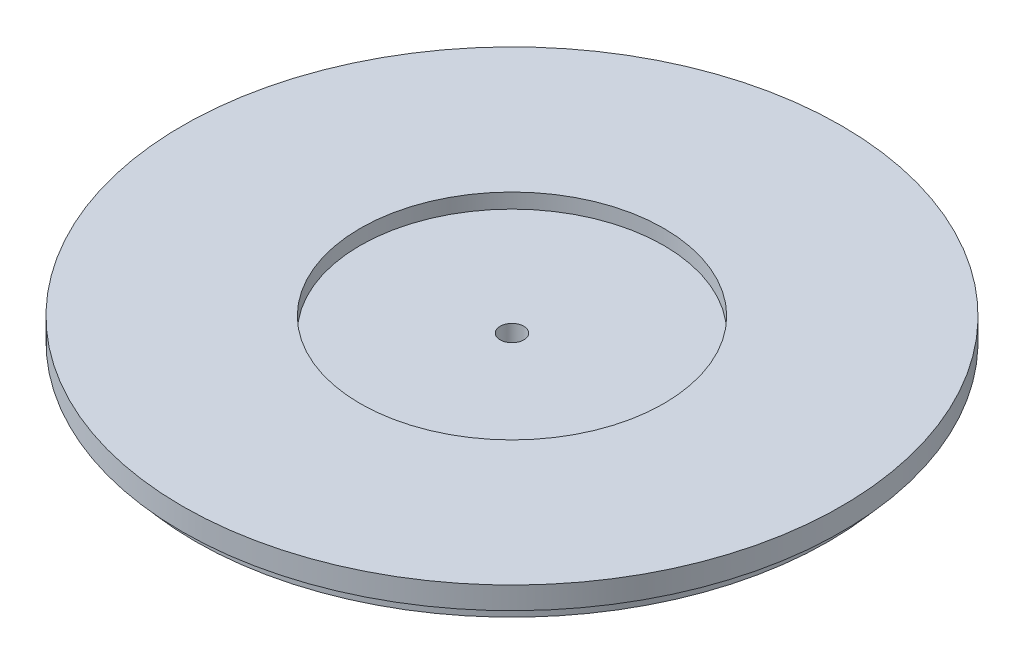
ISO-10303-21;
HEADER;
FILE_DESCRIPTION(('STEP AP214'),'2;1');
FILE_NAME('part.step','',(''),(''),'','','');
FILE_SCHEMA(('AUTOMOTIVE_DESIGN { 1 0 10303 214 1 1 1 1 }'));
ENDSEC;
DATA;
#1=APPLICATION_CONTEXT('core data for automotive mechanical design processes');
#2=APPLICATION_PROTOCOL_DEFINITION('international standard','automotive_design',2000,#1);
#3=PRODUCT_CONTEXT('',#1,'mechanical');
#4=PRODUCT('Part','Part','',(#3));
#5=PRODUCT_RELATED_PRODUCT_CATEGORY('part','',(#4));
#6=PRODUCT_DEFINITION_FORMATION('','',#4);
#7=PRODUCT_DEFINITION_CONTEXT('part definition',#1,'design');
#8=PRODUCT_DEFINITION('design','',#6,#7);
#9=PRODUCT_DEFINITION_SHAPE('','',#8);
#10=(LENGTH_UNIT() NAMED_UNIT(*) SI_UNIT(.MILLI.,.METRE.));
#11=(NAMED_UNIT(*) PLANE_ANGLE_UNIT() SI_UNIT($,.RADIAN.));
#12=(NAMED_UNIT(*) SI_UNIT($,.STERADIAN.) SOLID_ANGLE_UNIT());
#13=UNCERTAINTY_MEASURE_WITH_UNIT(LENGTH_MEASURE(1.E-05),#10,'distance_accuracy_value','');
#14=(GEOMETRIC_REPRESENTATION_CONTEXT(3) GLOBAL_UNCERTAINTY_ASSIGNED_CONTEXT((#13)) GLOBAL_UNIT_ASSIGNED_CONTEXT((#10,
#11,#12)) REPRESENTATION_CONTEXT('',''));
#15=CARTESIAN_POINT('',(0.,0.,0.));
#16=DIRECTION('',(0.,0.,1.));
#17=DIRECTION('',(1.,0.,0.));
#18=AXIS2_PLACEMENT_3D('',#15,#16,#17);
#19=CARTESIAN_POINT('',(-42.75,0.,0.));
#20=DIRECTION('',(0.,1.,0.));
#21=DIRECTION('',(0.,0.,1.));
#22=AXIS2_PLACEMENT_3D('',#19,#20,#21);
#23=PLANE('',#22);
#24=CARTESIAN_POINT('',(0.,0.,0.));
#25=DIRECTION('',(0.,-1.,0.));
#26=DIRECTION('',(0.,0.,-1.));
#27=AXIS2_PLACEMENT_3D('',#24,#25,#26);
#28=CIRCLE('',#27,1.6);
#29=CARTESIAN_POINT('',(0.,0.,-1.6));
#30=VERTEX_POINT('',#29);
#31=EDGE_CURVE('E10',#30,#30,#28,.T.);
#32=ORIENTED_EDGE('',*,*,#31,.F.);
#33=EDGE_LOOP('',(#32));
#34=FACE_BOUND('',#33,.T.);
#35=CARTESIAN_POINT('',(0.,0.,0.));
#36=DIRECTION('',(0.,-1.,0.));
#37=DIRECTION('',(0.,0.,-1.));
#38=AXIS2_PLACEMENT_3D('',#35,#36,#37);
#39=CIRCLE('',#38,42.75);
#40=CARTESIAN_POINT('',(0.,0.,-42.75));
#41=VERTEX_POINT('',#40);
#42=EDGE_CURVE('E62',#41,#41,#39,.T.);
#43=ORIENTED_EDGE('',*,*,#42,.T.);
#44=EDGE_LOOP('',(#43));
#45=FACE_BOUND('',#44,.T.);
#46=ADVANCED_FACE('F34',(#34,#45),#23,.F.);
#47=CARTESIAN_POINT('',(0.,-1.74146656785281,0.));
#48=DIRECTION('',(0.,-1.,0.));
#49=DIRECTION('',(0.,0.,-1.));
#50=AXIS2_PLACEMENT_3D('',#47,#48,#49);
#51=CYLINDRICAL_SURFACE('',#50,1.6);
#52=CARTESIAN_POINT('',(0.,3.,0.));
#53=DIRECTION('',(0.,-1.,0.));
#54=DIRECTION('',(0.,0.,-1.));
#55=AXIS2_PLACEMENT_3D('',#52,#53,#54);
#56=CIRCLE('',#55,1.6);
#57=CARTESIAN_POINT('',(0.,3.,-1.6));
#58=VERTEX_POINT('',#57);
#59=EDGE_CURVE('E40',#58,#58,#56,.T.);
#60=ORIENTED_EDGE('',*,*,#59,.F.);
#61=EDGE_LOOP('',(#60));
#62=FACE_BOUND('',#61,.T.);
#63=ORIENTED_EDGE('',*,*,#31,.T.);
#64=EDGE_LOOP('',(#63));
#65=FACE_BOUND('',#64,.T.);
#66=ADVANCED_FACE('F99',(#62,#65),#51,.F.);
#67=CARTESIAN_POINT('',(-1.6,3.,0.));
#68=DIRECTION('',(0.,-1.,0.));
#69=DIRECTION('',(0.,0.,-1.));
#70=AXIS2_PLACEMENT_3D('',#67,#68,#69);
#71=PLANE('',#70);
#72=CARTESIAN_POINT('',(0.,3.,0.));
#73=DIRECTION('',(0.,-1.,0.));
#74=DIRECTION('',(0.,0.,-1.));
#75=AXIS2_PLACEMENT_3D('',#72,#73,#74);
#76=CIRCLE('',#75,20.5);
#77=CARTESIAN_POINT('',(0.,3.,-20.5));
#78=VERTEX_POINT('',#77);
#79=EDGE_CURVE('E44',#78,#78,#76,.T.);
#80=ORIENTED_EDGE('',*,*,#79,.F.);
#81=EDGE_LOOP('',(#80));
#82=FACE_BOUND('',#81,.T.);
#83=ORIENTED_EDGE('',*,*,#59,.T.);
#84=EDGE_LOOP('',(#83));
#85=FACE_BOUND('',#84,.T.);
#86=ADVANCED_FACE('F94',(#82,#85),#71,.F.);
#87=CARTESIAN_POINT('',(0.,-1.74146656785281,0.));
#88=DIRECTION('',(0.,-1.,0.));
#89=DIRECTION('',(0.,0.,-1.));
#90=AXIS2_PLACEMENT_3D('',#87,#88,#89);
#91=CYLINDRICAL_SURFACE('',#90,20.5);
#92=CARTESIAN_POINT('',(0.,5.,0.));
#93=DIRECTION('',(0.,-1.,0.));
#94=DIRECTION('',(0.,0.,-1.));
#95=AXIS2_PLACEMENT_3D('',#92,#93,#94);
#96=CIRCLE('',#95,20.5);
#97=CARTESIAN_POINT('',(0.,5.,-20.5));
#98=VERTEX_POINT('',#97);
#99=EDGE_CURVE('E48',#98,#98,#96,.T.);
#100=ORIENTED_EDGE('',*,*,#99,.F.);
#101=EDGE_LOOP('',(#100));
#102=FACE_BOUND('',#101,.T.);
#103=ORIENTED_EDGE('',*,*,#79,.T.);
#104=EDGE_LOOP('',(#103));
#105=FACE_BOUND('',#104,.T.);
#106=ADVANCED_FACE('F88',(#102,#105),#91,.F.);
#107=CARTESIAN_POINT('',(-20.5,5.,0.));
#108=DIRECTION('',(0.,-1.,0.));
#109=DIRECTION('',(0.,0.,-1.));
#110=AXIS2_PLACEMENT_3D('',#107,#108,#109);
#111=PLANE('',#110);
#112=CARTESIAN_POINT('',(0.,5.,0.));
#113=DIRECTION('',(0.,-1.,0.));
#114=DIRECTION('',(0.,0.,-1.));
#115=AXIS2_PLACEMENT_3D('',#112,#113,#114);
#116=CIRCLE('',#115,44.5);
#117=CARTESIAN_POINT('',(0.,5.,-44.5));
#118=VERTEX_POINT('',#117);
#119=EDGE_CURVE('E53',#118,#118,#116,.T.);
#120=ORIENTED_EDGE('',*,*,#119,.F.);
#121=EDGE_LOOP('',(#120));
#122=FACE_BOUND('',#121,.T.);
#123=ORIENTED_EDGE('',*,*,#99,.T.);
#124=EDGE_LOOP('',(#123));
#125=FACE_BOUND('',#124,.T.);
#126=ADVANCED_FACE('F82',(#122,#125),#111,.F.);
#127=CARTESIAN_POINT('',(0.,-1.74146656785281,0.));
#128=DIRECTION('',(0.,-1.,0.));
#129=DIRECTION('',(0.,0.,-1.));
#130=AXIS2_PLACEMENT_3D('',#127,#128,#129);
#131=CYLINDRICAL_SURFACE('',#130,44.5);
#132=CARTESIAN_POINT('',(0.,2.,0.));
#133=DIRECTION('',(0.,-1.,0.));
#134=DIRECTION('',(0.,0.,-1.));
#135=AXIS2_PLACEMENT_3D('',#132,#133,#134);
#136=CIRCLE('',#135,44.5);
#137=CARTESIAN_POINT('',(0.,2.,-44.5));
#138=VERTEX_POINT('',#137);
#139=EDGE_CURVE('E56',#138,#138,#136,.T.);
#140=ORIENTED_EDGE('',*,*,#139,.F.);
#141=EDGE_LOOP('',(#140));
#142=FACE_BOUND('',#141,.T.);
#143=ORIENTED_EDGE('',*,*,#119,.T.);
#144=EDGE_LOOP('',(#143));
#145=FACE_BOUND('',#144,.T.);
#146=ADVANCED_FACE('F76',(#142,#145),#131,.T.);
#147=CARTESIAN_POINT('',(-44.5,2.,0.));
#148=DIRECTION('',(0.,1.,0.));
#149=DIRECTION('',(0.,0.,1.));
#150=AXIS2_PLACEMENT_3D('',#147,#148,#149);
#151=PLANE('',#150);
#152=CARTESIAN_POINT('',(0.,2.,0.));
#153=DIRECTION('',(0.,-1.,0.));
#154=DIRECTION('',(0.,0.,-1.));
#155=AXIS2_PLACEMENT_3D('',#152,#153,#154);
#156=CIRCLE('',#155,42.75);
#157=CARTESIAN_POINT('',(0.,2.,-42.75));
#158=VERTEX_POINT('',#157);
#159=EDGE_CURVE('E59',#158,#158,#156,.T.);
#160=ORIENTED_EDGE('',*,*,#159,.F.);
#161=EDGE_LOOP('',(#160));
#162=FACE_BOUND('',#161,.T.);
#163=ORIENTED_EDGE('',*,*,#139,.T.);
#164=EDGE_LOOP('',(#163));
#165=FACE_BOUND('',#164,.T.);
#166=ADVANCED_FACE('F70',(#162,#165),#151,.F.);
#167=CARTESIAN_POINT('',(0.,-1.74146656785281,0.));
#168=DIRECTION('',(0.,-1.,0.));
#169=DIRECTION('',(0.,0.,-1.));
#170=AXIS2_PLACEMENT_3D('',#167,#168,#169);
#171=CYLINDRICAL_SURFACE('',#170,42.75);
#172=ORIENTED_EDGE('',*,*,#42,.F.);
#173=EDGE_LOOP('',(#172));
#174=FACE_BOUND('',#173,.T.);
#175=ORIENTED_EDGE('',*,*,#159,.T.);
#176=EDGE_LOOP('',(#175));
#177=FACE_BOUND('',#176,.T.);
#178=ADVANCED_FACE('F67',(#174,#177),#171,.T.);
#179=CLOSED_SHELL('',(#46,#66,#86,#106,#126,#146,#166,#178));
#180=MANIFOLD_SOLID_BREP('B2',#179);
#181=ADVANCED_BREP_SHAPE_REPRESENTATION('',(#18,#180),#14);
#182=SHAPE_DEFINITION_REPRESENTATION(#9,#181);
ENDSEC;
END-ISO-10303-21;
